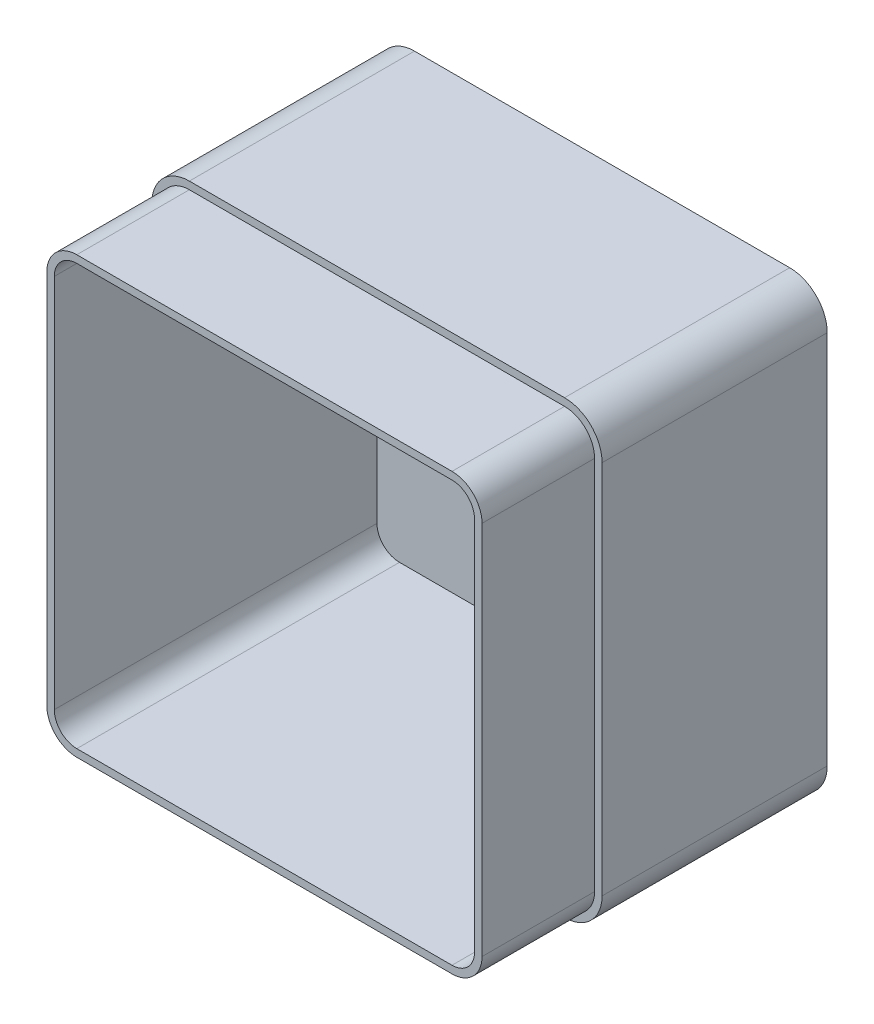
ISO-10303-21;
HEADER;
FILE_DESCRIPTION(('STEP AP214'),'2;1');
FILE_NAME('part.step','',(''),(''),'','','');
FILE_SCHEMA(('AUTOMOTIVE_DESIGN { 1 0 10303 214 1 1 1 1 }'));
ENDSEC;
DATA;
#1=APPLICATION_CONTEXT('core data for automotive mechanical design processes');
#2=APPLICATION_PROTOCOL_DEFINITION('international standard','automotive_design',2000,#1);
#3=PRODUCT_CONTEXT('',#1,'mechanical');
#4=PRODUCT('Part','Part','',(#3));
#5=PRODUCT_RELATED_PRODUCT_CATEGORY('part','',(#4));
#6=PRODUCT_DEFINITION_FORMATION('','',#4);
#7=PRODUCT_DEFINITION_CONTEXT('part definition',#1,'design');
#8=PRODUCT_DEFINITION('design','',#6,#7);
#9=PRODUCT_DEFINITION_SHAPE('','',#8);
#10=(LENGTH_UNIT() NAMED_UNIT(*) SI_UNIT(.MILLI.,.METRE.));
#11=(NAMED_UNIT(*) PLANE_ANGLE_UNIT() SI_UNIT($,.RADIAN.));
#12=(NAMED_UNIT(*) SI_UNIT($,.STERADIAN.) SOLID_ANGLE_UNIT());
#13=UNCERTAINTY_MEASURE_WITH_UNIT(LENGTH_MEASURE(1.E-05),#10,'distance_accuracy_value','');
#14=(GEOMETRIC_REPRESENTATION_CONTEXT(3) GLOBAL_UNCERTAINTY_ASSIGNED_CONTEXT((#13)) GLOBAL_UNIT_ASSIGNED_CONTEXT((#10,
#11,#12)) REPRESENTATION_CONTEXT('',''));
#15=CARTESIAN_POINT('',(0.,0.,0.));
#16=DIRECTION('',(0.,0.,1.));
#17=DIRECTION('',(1.,0.,0.));
#18=AXIS2_PLACEMENT_3D('',#15,#16,#17);
#19=CARTESIAN_POINT('',(0.,120.,90.));
#20=DIRECTION('',(0.,0.,-1.));
#21=DIRECTION('',(-1.,0.,0.));
#22=AXIS2_PLACEMENT_3D('',#19,#20,#21);
#23=PLANE('',#22);
#24=DIRECTION('',(1.,0.,0.));
#25=VECTOR('',#24,1.);
#26=CARTESIAN_POINT('',(0.,4.,90.));
#27=LINE('',#26,#25);
#28=CARTESIAN_POINT('',(9.99999999999999,4.,90.));
#29=VERTEX_POINT('',#28);
#30=CARTESIAN_POINT('',(110.,4.,90.));
#31=VERTEX_POINT('',#30);
#32=EDGE_CURVE('E337',#29,#31,#27,.T.);
#33=ORIENTED_EDGE('',*,*,#32,.F.);
#34=CARTESIAN_POINT('',(10.,10.,90.));
#35=DIRECTION('',(0.,0.,-1.));
#36=DIRECTION('',(-1.,0.,0.));
#37=AXIS2_PLACEMENT_3D('',#34,#35,#36);
#38=CIRCLE('',#37,6.);
#39=CARTESIAN_POINT('',(4.,9.99999999999999,90.));
#40=VERTEX_POINT('',#39);
#41=EDGE_CURVE('E295',#40,#29,#38,.F.);
#42=ORIENTED_EDGE('',*,*,#41,.F.);
#43=DIRECTION('',(0.,-1.,0.));
#44=VECTOR('',#43,1.);
#45=CARTESIAN_POINT('',(4.,120.,90.));
#46=LINE('',#45,#44);
#47=CARTESIAN_POINT('',(4.,110.,90.));
#48=VERTEX_POINT('',#47);
#49=EDGE_CURVE('E317',#48,#40,#46,.T.);
#50=ORIENTED_EDGE('',*,*,#49,.F.);
#51=CARTESIAN_POINT('',(10.,110.,90.));
#52=DIRECTION('',(0.,0.,-1.));
#53=DIRECTION('',(-1.,0.,0.));
#54=AXIS2_PLACEMENT_3D('',#51,#52,#53);
#55=CIRCLE('',#54,6.);
#56=CARTESIAN_POINT('',(9.99999999999999,116.,90.));
#57=VERTEX_POINT('',#56);
#58=EDGE_CURVE('E327',#57,#48,#55,.F.);
#59=ORIENTED_EDGE('',*,*,#58,.F.);
#60=DIRECTION('',(-1.,0.,0.));
#61=VECTOR('',#60,1.);
#62=CARTESIAN_POINT('',(0.,116.,90.));
#63=LINE('',#62,#61);
#64=CARTESIAN_POINT('',(110.,116.,90.));
#65=VERTEX_POINT('',#64);
#66=EDGE_CURVE('E334',#65,#57,#63,.T.);
#67=ORIENTED_EDGE('',*,*,#66,.F.);
#68=CARTESIAN_POINT('',(110.,110.,90.));
#69=DIRECTION('',(0.,0.,-1.));
#70=DIRECTION('',(-1.,0.,0.));
#71=AXIS2_PLACEMENT_3D('',#68,#69,#70);
#72=CIRCLE('',#71,6.);
#73=CARTESIAN_POINT('',(116.,110.,90.));
#74=VERTEX_POINT('',#73);
#75=EDGE_CURVE('E301',#74,#65,#72,.F.);
#76=ORIENTED_EDGE('',*,*,#75,.F.);
#77=DIRECTION('',(0.,1.,0.));
#78=VECTOR('',#77,1.);
#79=CARTESIAN_POINT('',(116.,120.,90.));
#80=LINE('',#79,#78);
#81=CARTESIAN_POINT('',(116.,9.99999999999999,90.));
#82=VERTEX_POINT('',#81);
#83=EDGE_CURVE('E341',#82,#74,#80,.T.);
#84=ORIENTED_EDGE('',*,*,#83,.F.);
#85=CARTESIAN_POINT('',(110.,10.,90.));
#86=DIRECTION('',(0.,0.,-1.));
#87=DIRECTION('',(-1.,0.,0.));
#88=AXIS2_PLACEMENT_3D('',#85,#86,#87);
#89=CIRCLE('',#88,6.);
#90=EDGE_CURVE('E324',#31,#82,#89,.F.);
#91=ORIENTED_EDGE('',*,*,#90,.F.);
#92=EDGE_LOOP('',(#33,#42,#50,#59,#67,#76,#84,#91));
#93=FACE_BOUND('',#92,.T.);
#94=CARTESIAN_POINT('',(10.,10.,90.));
#95=DIRECTION('',(0.,0.,1.));
#96=DIRECTION('',(1.,0.,0.));
#97=AXIS2_PLACEMENT_3D('',#94,#95,#96);
#98=CIRCLE('',#97,8.);
#99=CARTESIAN_POINT('',(2.,9.99999999999999,90.));
#100=VERTEX_POINT('',#99);
#101=CARTESIAN_POINT('',(9.99999999999999,2.,90.));
#102=VERTEX_POINT('',#101);
#103=EDGE_CURVE('E225',#100,#102,#98,.T.);
#104=ORIENTED_EDGE('',*,*,#103,.T.);
#105=DIRECTION('',(1.,0.,0.));
#106=VECTOR('',#105,1.);
#107=CARTESIAN_POINT('',(10.,2.,90.));
#108=LINE('',#107,#106);
#109=CARTESIAN_POINT('',(110.,2.,90.));
#110=VERTEX_POINT('',#109);
#111=EDGE_CURVE('E223',#102,#110,#108,.T.);
#112=ORIENTED_EDGE('',*,*,#111,.T.);
#113=CARTESIAN_POINT('',(110.,10.,90.));
#114=DIRECTION('',(0.,0.,1.));
#115=DIRECTION('',(1.,0.,0.));
#116=AXIS2_PLACEMENT_3D('',#113,#114,#115);
#117=CIRCLE('',#116,7.99999999999999);
#118=CARTESIAN_POINT('',(118.,10.,90.));
#119=VERTEX_POINT('',#118);
#120=EDGE_CURVE('E58',#110,#119,#117,.T.);
#121=ORIENTED_EDGE('',*,*,#120,.T.);
#122=DIRECTION('',(0.,1.,0.));
#123=VECTOR('',#122,1.);
#124=CARTESIAN_POINT('',(118.,10.,90.));
#125=LINE('',#124,#123);
#126=CARTESIAN_POINT('',(118.,110.,90.));
#127=VERTEX_POINT('',#126);
#128=EDGE_CURVE('E213',#119,#127,#125,.T.);
#129=ORIENTED_EDGE('',*,*,#128,.T.);
#130=CARTESIAN_POINT('',(110.,110.,90.));
#131=DIRECTION('',(0.,0.,1.));
#132=DIRECTION('',(1.,0.,0.));
#133=AXIS2_PLACEMENT_3D('',#130,#131,#132);
#134=CIRCLE('',#133,7.99999999999999);
#135=CARTESIAN_POINT('',(110.,118.,90.));
#136=VERTEX_POINT('',#135);
#137=EDGE_CURVE('E218',#127,#136,#134,.T.);
#138=ORIENTED_EDGE('',*,*,#137,.T.);
#139=DIRECTION('',(-1.,0.,0.));
#140=VECTOR('',#139,1.);
#141=CARTESIAN_POINT('',(110.,118.,90.));
#142=LINE('',#141,#140);
#143=CARTESIAN_POINT('',(9.99999999999999,118.,90.));
#144=VERTEX_POINT('',#143);
#145=EDGE_CURVE('E230',#136,#144,#142,.T.);
#146=ORIENTED_EDGE('',*,*,#145,.T.);
#147=CARTESIAN_POINT('',(10.,110.,90.));
#148=DIRECTION('',(0.,0.,1.));
#149=DIRECTION('',(1.,0.,0.));
#150=AXIS2_PLACEMENT_3D('',#147,#148,#149);
#151=CIRCLE('',#150,7.99999999999999);
#152=CARTESIAN_POINT('',(2.,110.,90.));
#153=VERTEX_POINT('',#152);
#154=EDGE_CURVE('E233',#144,#153,#151,.T.);
#155=ORIENTED_EDGE('',*,*,#154,.T.);
#156=DIRECTION('',(0.,-1.,0.));
#157=VECTOR('',#156,1.);
#158=CARTESIAN_POINT('',(2.,110.,90.));
#159=LINE('',#158,#157);
#160=EDGE_CURVE('E236',#153,#100,#159,.T.);
#161=ORIENTED_EDGE('',*,*,#160,.T.);
#162=EDGE_LOOP('',(#104,#112,#121,#129,#138,#146,#155,#161));
#163=FACE_BOUND('',#162,.T.);
#164=ADVANCED_FACE('F43',(#93,#163),#23,.F.);
#165=CARTESIAN_POINT('',(4.,0.,90.));
#166=DIRECTION('',(1.,0.,0.));
#167=DIRECTION('',(0.,0.,-1.));
#168=AXIS2_PLACEMENT_3D('',#165,#166,#167);
#169=PLANE('',#168);
#170=DIRECTION('',(0.,-1.,0.));
#171=VECTOR('',#170,1.);
#172=CARTESIAN_POINT('',(4.,120.,4.));
#173=LINE('',#172,#171);
#174=CARTESIAN_POINT('',(4.,110.,4.));
#175=VERTEX_POINT('',#174);
#176=CARTESIAN_POINT('',(4.,9.99999999999999,4.));
#177=VERTEX_POINT('',#176);
#178=EDGE_CURVE('E288',#175,#177,#173,.T.);
#179=ORIENTED_EDGE('',*,*,#178,.F.);
#180=DIRECTION('',(0.,0.,-1.));
#181=VECTOR('',#180,1.);
#182=CARTESIAN_POINT('',(4.,110.,90.));
#183=LINE('',#182,#181);
#184=EDGE_CURVE('E297',#48,#175,#183,.T.);
#185=ORIENTED_EDGE('',*,*,#184,.F.);
#186=ORIENTED_EDGE('',*,*,#49,.T.);
#187=DIRECTION('',(0.,0.,-1.));
#188=VECTOR('',#187,1.);
#189=CARTESIAN_POINT('',(4.,9.99999999999999,90.));
#190=LINE('',#189,#188);
#191=EDGE_CURVE('E292',#177,#40,#190,.F.);
#192=ORIENTED_EDGE('',*,*,#191,.F.);
#193=EDGE_LOOP('',(#179,#185,#186,#192));
#194=FACE_BOUND('',#193,.T.);
#195=ADVANCED_FACE('F436',(#194),#169,.T.);
#196=CARTESIAN_POINT('',(0.,4.,90.));
#197=DIRECTION('',(0.,1.,0.));
#198=DIRECTION('',(0.,0.,1.));
#199=AXIS2_PLACEMENT_3D('',#196,#197,#198);
#200=PLANE('',#199);
#201=DIRECTION('',(1.,0.,0.));
#202=VECTOR('',#201,1.);
#203=CARTESIAN_POINT('',(0.,4.,4.));
#204=LINE('',#203,#202);
#205=CARTESIAN_POINT('',(9.99999999999999,4.,4.));
#206=VERTEX_POINT('',#205);
#207=CARTESIAN_POINT('',(110.,4.,4.));
#208=VERTEX_POINT('',#207);
#209=EDGE_CURVE('E291',#206,#208,#204,.T.);
#210=ORIENTED_EDGE('',*,*,#209,.F.);
#211=DIRECTION('',(0.,0.,1.));
#212=VECTOR('',#211,1.);
#213=CARTESIAN_POINT('',(9.99999999999999,4.,90.));
#214=LINE('',#213,#212);
#215=EDGE_CURVE('E312',#29,#206,#214,.F.);
#216=ORIENTED_EDGE('',*,*,#215,.F.);
#217=ORIENTED_EDGE('',*,*,#32,.T.);
#218=DIRECTION('',(0.,0.,1.));
#219=VECTOR('',#218,1.);
#220=CARTESIAN_POINT('',(110.,4.,90.));
#221=LINE('',#220,#219);
#222=EDGE_CURVE('E307',#208,#31,#221,.T.);
#223=ORIENTED_EDGE('',*,*,#222,.F.);
#224=EDGE_LOOP('',(#210,#216,#217,#223));
#225=FACE_BOUND('',#224,.T.);
#226=ADVANCED_FACE('F441',(#225),#200,.T.);
#227=CARTESIAN_POINT('',(116.,0.,90.));
#228=DIRECTION('',(-1.,0.,0.));
#229=DIRECTION('',(0.,0.,1.));
#230=AXIS2_PLACEMENT_3D('',#227,#228,#229);
#231=PLANE('',#230);
#232=ORIENTED_EDGE('',*,*,#83,.T.);
#233=DIRECTION('',(0.,0.,1.));
#234=VECTOR('',#233,1.);
#235=CARTESIAN_POINT('',(116.,110.,90.));
#236=LINE('',#235,#234);
#237=CARTESIAN_POINT('',(116.,110.,4.));
#238=VERTEX_POINT('',#237);
#239=EDGE_CURVE('E321',#238,#74,#236,.T.);
#240=ORIENTED_EDGE('',*,*,#239,.F.);
#241=DIRECTION('',(0.,1.,0.));
#242=VECTOR('',#241,1.);
#243=CARTESIAN_POINT('',(116.,120.,4.));
#244=LINE('',#243,#242);
#245=CARTESIAN_POINT('',(116.,9.99999999999999,4.));
#246=VERTEX_POINT('',#245);
#247=EDGE_CURVE('E302',#246,#238,#244,.T.);
#248=ORIENTED_EDGE('',*,*,#247,.F.);
#249=DIRECTION('',(0.,0.,1.));
#250=VECTOR('',#249,1.);
#251=CARTESIAN_POINT('',(116.,9.99999999999999,90.));
#252=LINE('',#251,#250);
#253=EDGE_CURVE('E308',#82,#246,#252,.F.);
#254=ORIENTED_EDGE('',*,*,#253,.F.);
#255=EDGE_LOOP('',(#232,#240,#248,#254));
#256=FACE_BOUND('',#255,.T.);
#257=ADVANCED_FACE('F631',(#256),#231,.T.);
#258=CARTESIAN_POINT('',(0.,116.,90.));
#259=DIRECTION('',(0.,-1.,0.));
#260=DIRECTION('',(0.,0.,-1.));
#261=AXIS2_PLACEMENT_3D('',#258,#259,#260);
#262=PLANE('',#261);
#263=DIRECTION('',(-1.,0.,0.));
#264=VECTOR('',#263,1.);
#265=CARTESIAN_POINT('',(0.,116.,4.));
#266=LINE('',#265,#264);
#267=CARTESIAN_POINT('',(110.,116.,4.));
#268=VERTEX_POINT('',#267);
#269=CARTESIAN_POINT('',(9.99999999999999,116.,4.));
#270=VERTEX_POINT('',#269);
#271=EDGE_CURVE('E304',#268,#270,#266,.T.);
#272=ORIENTED_EDGE('',*,*,#271,.F.);
#273=DIRECTION('',(0.,0.,-1.));
#274=VECTOR('',#273,1.);
#275=CARTESIAN_POINT('',(110.,116.,90.));
#276=LINE('',#275,#274);
#277=EDGE_CURVE('E322',#65,#268,#276,.T.);
#278=ORIENTED_EDGE('',*,*,#277,.F.);
#279=ORIENTED_EDGE('',*,*,#66,.T.);
#280=DIRECTION('',(0.,0.,-1.));
#281=VECTOR('',#280,1.);
#282=CARTESIAN_POINT('',(9.99999999999999,116.,90.));
#283=LINE('',#282,#281);
#284=EDGE_CURVE('E314',#270,#57,#283,.F.);
#285=ORIENTED_EDGE('',*,*,#284,.F.);
#286=EDGE_LOOP('',(#272,#278,#279,#285));
#287=FACE_BOUND('',#286,.T.);
#288=ADVANCED_FACE('F623',(#287),#262,.T.);
#289=CARTESIAN_POINT('',(0.,120.,4.));
#290=DIRECTION('',(0.,0.,-1.));
#291=DIRECTION('',(-1.,0.,0.));
#292=AXIS2_PLACEMENT_3D('',#289,#290,#291);
#293=PLANE('',#292);
#294=ORIENTED_EDGE('',*,*,#247,.T.);
#295=CARTESIAN_POINT('',(110.,110.,4.));
#296=DIRECTION('',(0.,0.,-1.));
#297=DIRECTION('',(-1.,0.,0.));
#298=AXIS2_PLACEMENT_3D('',#295,#296,#297);
#299=CIRCLE('',#298,6.);
#300=EDGE_CURVE('E318',#268,#238,#299,.T.);
#301=ORIENTED_EDGE('',*,*,#300,.F.);
#302=ORIENTED_EDGE('',*,*,#271,.T.);
#303=CARTESIAN_POINT('',(10.,110.,4.));
#304=DIRECTION('',(0.,0.,-1.));
#305=DIRECTION('',(-1.,0.,0.));
#306=AXIS2_PLACEMENT_3D('',#303,#304,#305);
#307=CIRCLE('',#306,6.);
#308=EDGE_CURVE('E300',#175,#270,#307,.T.);
#309=ORIENTED_EDGE('',*,*,#308,.F.);
#310=ORIENTED_EDGE('',*,*,#178,.T.);
#311=CARTESIAN_POINT('',(10.,10.,4.));
#312=DIRECTION('',(0.,0.,-1.));
#313=DIRECTION('',(-1.,0.,0.));
#314=AXIS2_PLACEMENT_3D('',#311,#312,#313);
#315=CIRCLE('',#314,6.);
#316=EDGE_CURVE('E296',#206,#177,#315,.T.);
#317=ORIENTED_EDGE('',*,*,#316,.F.);
#318=ORIENTED_EDGE('',*,*,#209,.T.);
#319=CARTESIAN_POINT('',(110.,10.,4.));
#320=DIRECTION('',(0.,0.,-1.));
#321=DIRECTION('',(-1.,0.,0.));
#322=AXIS2_PLACEMENT_3D('',#319,#320,#321);
#323=CIRCLE('',#322,6.);
#324=EDGE_CURVE('E305',#246,#208,#323,.T.);
#325=ORIENTED_EDGE('',*,*,#324,.F.);
#326=EDGE_LOOP('',(#294,#301,#302,#309,#310,#317,#318,#325));
#327=FACE_BOUND('',#326,.T.);
#328=ADVANCED_FACE('F615',(#327),#293,.F.);
#329=CARTESIAN_POINT('',(110.,110.,90.));
#330=DIRECTION('',(0.,0.,-1.));
#331=DIRECTION('',(-1.,0.,0.));
#332=AXIS2_PLACEMENT_3D('',#329,#330,#331);
#333=CYLINDRICAL_SURFACE('',#332,6.);
#334=ORIENTED_EDGE('',*,*,#75,.T.);
#335=ORIENTED_EDGE('',*,*,#277,.T.);
#336=ORIENTED_EDGE('',*,*,#300,.T.);
#337=ORIENTED_EDGE('',*,*,#239,.T.);
#338=EDGE_LOOP('',(#334,#335,#336,#337));
#339=FACE_BOUND('',#338,.T.);
#340=ADVANCED_FACE('F607',(#339),#333,.F.);
#341=CARTESIAN_POINT('',(10.,110.,90.));
#342=DIRECTION('',(0.,0.,-1.));
#343=DIRECTION('',(-1.,0.,0.));
#344=AXIS2_PLACEMENT_3D('',#341,#342,#343);
#345=CYLINDRICAL_SURFACE('',#344,6.);
#346=ORIENTED_EDGE('',*,*,#58,.T.);
#347=ORIENTED_EDGE('',*,*,#184,.T.);
#348=ORIENTED_EDGE('',*,*,#308,.T.);
#349=ORIENTED_EDGE('',*,*,#284,.T.);
#350=EDGE_LOOP('',(#346,#347,#348,#349));
#351=FACE_BOUND('',#350,.T.);
#352=ADVANCED_FACE('F599',(#351),#345,.F.);
#353=CARTESIAN_POINT('',(10.,10.,90.));
#354=DIRECTION('',(0.,0.,-1.));
#355=DIRECTION('',(-1.,0.,0.));
#356=AXIS2_PLACEMENT_3D('',#353,#354,#355);
#357=CYLINDRICAL_SURFACE('',#356,6.);
#358=ORIENTED_EDGE('',*,*,#41,.T.);
#359=ORIENTED_EDGE('',*,*,#215,.T.);
#360=ORIENTED_EDGE('',*,*,#316,.T.);
#361=ORIENTED_EDGE('',*,*,#191,.T.);
#362=EDGE_LOOP('',(#358,#359,#360,#361));
#363=FACE_BOUND('',#362,.T.);
#364=ADVANCED_FACE('F592',(#363),#357,.F.);
#365=CARTESIAN_POINT('',(110.,10.,90.));
#366=DIRECTION('',(0.,0.,-1.));
#367=DIRECTION('',(-1.,0.,0.));
#368=AXIS2_PLACEMENT_3D('',#365,#366,#367);
#369=CYLINDRICAL_SURFACE('',#368,6.);
#370=ORIENTED_EDGE('',*,*,#90,.T.);
#371=ORIENTED_EDGE('',*,*,#253,.T.);
#372=ORIENTED_EDGE('',*,*,#324,.T.);
#373=ORIENTED_EDGE('',*,*,#222,.T.);
#374=EDGE_LOOP('',(#370,#371,#372,#373));
#375=FACE_BOUND('',#374,.T.);
#376=ADVANCED_FACE('F508',(#375),#369,.F.);
#377=CARTESIAN_POINT('',(60.,60.,60.));
#378=DIRECTION('',(0.,0.,1.));
#379=DIRECTION('',(1.,0.,0.));
#380=AXIS2_PLACEMENT_3D('',#377,#378,#379);
#381=PLANE('',#380);
#382=DIRECTION('',(0.,-1.,0.));
#383=VECTOR('',#382,1.);
#384=CARTESIAN_POINT('',(0.,0.,60.));
#385=LINE('',#384,#383);
#386=CARTESIAN_POINT('',(0.,110.,60.));
#387=VERTEX_POINT('',#386);
#388=CARTESIAN_POINT('',(0.,10.,60.));
#389=VERTEX_POINT('',#388);
#390=EDGE_CURVE('E283',#387,#389,#385,.T.);
#391=ORIENTED_EDGE('',*,*,#390,.T.);
#392=CARTESIAN_POINT('',(10.,10.,60.));
#393=DIRECTION('',(0.,0.,1.));
#394=DIRECTION('',(1.,0.,0.));
#395=AXIS2_PLACEMENT_3D('',#392,#393,#394);
#396=CIRCLE('',#395,10.);
#397=CARTESIAN_POINT('',(10.,0.,60.));
#398=VERTEX_POINT('',#397);
#399=EDGE_CURVE('E275',#398,#389,#396,.F.);
#400=ORIENTED_EDGE('',*,*,#399,.F.);
#401=DIRECTION('',(1.,0.,0.));
#402=VECTOR('',#401,1.);
#403=CARTESIAN_POINT('',(0.,0.,60.));
#404=LINE('',#403,#402);
#405=CARTESIAN_POINT('',(110.,0.,60.));
#406=VERTEX_POINT('',#405);
#407=EDGE_CURVE('E66',#398,#406,#404,.T.);
#408=ORIENTED_EDGE('',*,*,#407,.T.);
#409=CARTESIAN_POINT('',(110.,10.,60.));
#410=DIRECTION('',(0.,0.,1.));
#411=DIRECTION('',(1.,0.,0.));
#412=AXIS2_PLACEMENT_3D('',#409,#410,#411);
#413=CIRCLE('',#412,10.);
#414=CARTESIAN_POINT('',(120.,10.,60.));
#415=VERTEX_POINT('',#414);
#416=EDGE_CURVE('E14',#415,#406,#413,.F.);
#417=ORIENTED_EDGE('',*,*,#416,.F.);
#418=DIRECTION('',(0.,1.,0.));
#419=VECTOR('',#418,1.);
#420=CARTESIAN_POINT('',(120.,0.,60.));
#421=LINE('',#420,#419);
#422=CARTESIAN_POINT('',(120.,110.,60.));
#423=VERTEX_POINT('',#422);
#424=EDGE_CURVE('E263',#415,#423,#421,.T.);
#425=ORIENTED_EDGE('',*,*,#424,.T.);
#426=CARTESIAN_POINT('',(110.,110.,60.));
#427=DIRECTION('',(0.,0.,1.));
#428=DIRECTION('',(1.,0.,0.));
#429=AXIS2_PLACEMENT_3D('',#426,#427,#428);
#430=CIRCLE('',#429,10.);
#431=CARTESIAN_POINT('',(110.,120.,60.));
#432=VERTEX_POINT('',#431);
#433=EDGE_CURVE('E278',#432,#423,#430,.F.);
#434=ORIENTED_EDGE('',*,*,#433,.F.);
#435=DIRECTION('',(-1.,0.,0.));
#436=VECTOR('',#435,1.);
#437=CARTESIAN_POINT('',(0.,120.,60.));
#438=LINE('',#437,#436);
#439=CARTESIAN_POINT('',(10.,120.,60.));
#440=VERTEX_POINT('',#439);
#441=EDGE_CURVE('E281',#432,#440,#438,.T.);
#442=ORIENTED_EDGE('',*,*,#441,.T.);
#443=CARTESIAN_POINT('',(10.,110.,60.));
#444=DIRECTION('',(0.,0.,1.));
#445=DIRECTION('',(1.,0.,0.));
#446=AXIS2_PLACEMENT_3D('',#443,#444,#445);
#447=CIRCLE('',#446,10.);
#448=EDGE_CURVE('E285',#387,#440,#447,.F.);
#449=ORIENTED_EDGE('',*,*,#448,.F.);
#450=EDGE_LOOP('',(#391,#400,#408,#417,#425,#434,#442,#449));
#451=FACE_BOUND('',#450,.T.);
#452=DIRECTION('',(0.,-1.,0.));
#453=VECTOR('',#452,1.);
#454=CARTESIAN_POINT('',(2.,110.,60.));
#455=LINE('',#454,#453);
#456=CARTESIAN_POINT('',(2.,110.,60.));
#457=VERTEX_POINT('',#456);
#458=CARTESIAN_POINT('',(2.,9.99999999999999,60.));
#459=VERTEX_POINT('',#458);
#460=EDGE_CURVE('E257',#457,#459,#455,.T.);
#461=ORIENTED_EDGE('',*,*,#460,.F.);
#462=CARTESIAN_POINT('',(10.,110.,60.));
#463=DIRECTION('',(0.,0.,1.));
#464=DIRECTION('',(1.,0.,0.));
#465=AXIS2_PLACEMENT_3D('',#462,#463,#464);
#466=CIRCLE('',#465,7.99999999999999);
#467=CARTESIAN_POINT('',(9.99999999999999,118.,60.));
#468=VERTEX_POINT('',#467);
#469=EDGE_CURVE('E254',#468,#457,#466,.T.);
#470=ORIENTED_EDGE('',*,*,#469,.F.);
#471=DIRECTION('',(-1.,0.,0.));
#472=VECTOR('',#471,1.);
#473=CARTESIAN_POINT('',(110.,118.,60.));
#474=LINE('',#473,#472);
#475=CARTESIAN_POINT('',(110.,118.,60.));
#476=VERTEX_POINT('',#475);
#477=EDGE_CURVE('E251',#476,#468,#474,.T.);
#478=ORIENTED_EDGE('',*,*,#477,.F.);
#479=CARTESIAN_POINT('',(110.,110.,60.));
#480=DIRECTION('',(0.,0.,1.));
#481=DIRECTION('',(1.,0.,0.));
#482=AXIS2_PLACEMENT_3D('',#479,#480,#481);
#483=CIRCLE('',#482,7.99999999999999);
#484=CARTESIAN_POINT('',(118.,110.,60.));
#485=VERTEX_POINT('',#484);
#486=EDGE_CURVE('E248',#485,#476,#483,.T.);
#487=ORIENTED_EDGE('',*,*,#486,.F.);
#488=DIRECTION('',(0.,1.,0.));
#489=VECTOR('',#488,1.);
#490=CARTESIAN_POINT('',(118.,10.,60.));
#491=LINE('',#490,#489);
#492=CARTESIAN_POINT('',(118.,10.,60.));
#493=VERTEX_POINT('',#492);
#494=EDGE_CURVE('E246',#493,#485,#491,.T.);
#495=ORIENTED_EDGE('',*,*,#494,.F.);
#496=CARTESIAN_POINT('',(110.,10.,60.));
#497=DIRECTION('',(0.,0.,1.));
#498=DIRECTION('',(1.,0.,0.));
#499=AXIS2_PLACEMENT_3D('',#496,#497,#498);
#500=CIRCLE('',#499,7.99999999999999);
#501=CARTESIAN_POINT('',(110.,2.,60.));
#502=VERTEX_POINT('',#501);
#503=EDGE_CURVE('E205',#502,#493,#500,.T.);
#504=ORIENTED_EDGE('',*,*,#503,.F.);
#505=DIRECTION('',(1.,0.,0.));
#506=VECTOR('',#505,1.);
#507=CARTESIAN_POINT('',(10.,2.,60.));
#508=LINE('',#507,#506);
#509=CARTESIAN_POINT('',(10.,2.,60.));
#510=VERTEX_POINT('',#509);
#511=EDGE_CURVE('E242',#510,#502,#508,.T.);
#512=ORIENTED_EDGE('',*,*,#511,.F.);
#513=CARTESIAN_POINT('',(10.,10.,60.));
#514=DIRECTION('',(0.,0.,1.));
#515=DIRECTION('',(1.,0.,0.));
#516=AXIS2_PLACEMENT_3D('',#513,#514,#515);
#517=CIRCLE('',#516,8.);
#518=EDGE_CURVE('E239',#459,#510,#517,.T.);
#519=ORIENTED_EDGE('',*,*,#518,.F.);
#520=EDGE_LOOP('',(#461,#470,#478,#487,#495,#504,#512,#519));
#521=FACE_BOUND('',#520,.T.);
#522=ADVANCED_FACE('F396',(#451,#521),#381,.T.);
#523=CARTESIAN_POINT('',(10.,10.,60.));
#524=DIRECTION('',(0.,0.,1.));
#525=DIRECTION('',(1.,0.,0.));
#526=AXIS2_PLACEMENT_3D('',#523,#524,#525);
#527=CYLINDRICAL_SURFACE('',#526,8.);
#528=ORIENTED_EDGE('',*,*,#103,.F.);
#529=DIRECTION('',(0.,0.,1.));
#530=VECTOR('',#529,1.);
#531=CARTESIAN_POINT('',(2.,9.99999999999999,60.));
#532=LINE('',#531,#530);
#533=EDGE_CURVE('E261',#459,#100,#532,.T.);
#534=ORIENTED_EDGE('',*,*,#533,.F.);
#535=ORIENTED_EDGE('',*,*,#518,.T.);
#536=DIRECTION('',(0.,0.,1.));
#537=VECTOR('',#536,1.);
#538=CARTESIAN_POINT('',(10.,2.,60.));
#539=LINE('',#538,#537);
#540=EDGE_CURVE('E260',#510,#102,#539,.T.);
#541=ORIENTED_EDGE('',*,*,#540,.T.);
#542=EDGE_LOOP('',(#528,#534,#535,#541));
#543=FACE_BOUND('',#542,.T.);
#544=ADVANCED_FACE('F507',(#543),#527,.T.);
#545=CARTESIAN_POINT('',(2.,110.,60.));
#546=DIRECTION('',(-1.,0.,0.));
#547=DIRECTION('',(0.,-1.,0.));
#548=AXIS2_PLACEMENT_3D('',#545,#546,#547);
#549=PLANE('',#548);
#550=ORIENTED_EDGE('',*,*,#160,.F.);
#551=DIRECTION('',(0.,0.,1.));
#552=VECTOR('',#551,1.);
#553=CARTESIAN_POINT('',(2.,110.,60.));
#554=LINE('',#553,#552);
#555=EDGE_CURVE('E264',#457,#153,#554,.T.);
#556=ORIENTED_EDGE('',*,*,#555,.F.);
#557=ORIENTED_EDGE('',*,*,#460,.T.);
#558=ORIENTED_EDGE('',*,*,#533,.T.);
#559=EDGE_LOOP('',(#550,#556,#557,#558));
#560=FACE_BOUND('',#559,.T.);
#561=ADVANCED_FACE('F516',(#560),#549,.T.);
#562=CARTESIAN_POINT('',(10.,110.,60.));
#563=DIRECTION('',(0.,0.,1.));
#564=DIRECTION('',(1.,0.,0.));
#565=AXIS2_PLACEMENT_3D('',#562,#563,#564);
#566=CYLINDRICAL_SURFACE('',#565,7.99999999999999);
#567=ORIENTED_EDGE('',*,*,#154,.F.);
#568=DIRECTION('',(0.,0.,1.));
#569=VECTOR('',#568,1.);
#570=CARTESIAN_POINT('',(9.99999999999999,118.,60.));
#571=LINE('',#570,#569);
#572=EDGE_CURVE('E266',#468,#144,#571,.T.);
#573=ORIENTED_EDGE('',*,*,#572,.F.);
#574=ORIENTED_EDGE('',*,*,#469,.T.);
#575=ORIENTED_EDGE('',*,*,#555,.T.);
#576=EDGE_LOOP('',(#567,#573,#574,#575));
#577=FACE_BOUND('',#576,.T.);
#578=ADVANCED_FACE('F525',(#577),#566,.T.);
#579=CARTESIAN_POINT('',(110.,118.,60.));
#580=DIRECTION('',(0.,1.,0.));
#581=DIRECTION('',(0.,0.,1.));
#582=AXIS2_PLACEMENT_3D('',#579,#580,#581);
#583=PLANE('',#582);
#584=ORIENTED_EDGE('',*,*,#145,.F.);
#585=DIRECTION('',(0.,0.,1.));
#586=VECTOR('',#585,1.);
#587=CARTESIAN_POINT('',(110.,118.,60.));
#588=LINE('',#587,#586);
#589=EDGE_CURVE('E268',#476,#136,#588,.T.);
#590=ORIENTED_EDGE('',*,*,#589,.F.);
#591=ORIENTED_EDGE('',*,*,#477,.T.);
#592=ORIENTED_EDGE('',*,*,#572,.T.);
#593=EDGE_LOOP('',(#584,#590,#591,#592));
#594=FACE_BOUND('',#593,.T.);
#595=ADVANCED_FACE('F534',(#594),#583,.T.);
#596=CARTESIAN_POINT('',(110.,110.,60.));
#597=DIRECTION('',(0.,0.,1.));
#598=DIRECTION('',(1.,0.,0.));
#599=AXIS2_PLACEMENT_3D('',#596,#597,#598);
#600=CYLINDRICAL_SURFACE('',#599,7.99999999999999);
#601=ORIENTED_EDGE('',*,*,#137,.F.);
#602=DIRECTION('',(0.,0.,1.));
#603=VECTOR('',#602,1.);
#604=CARTESIAN_POINT('',(118.,110.,60.));
#605=LINE('',#604,#603);
#606=EDGE_CURVE('E209',#485,#127,#605,.T.);
#607=ORIENTED_EDGE('',*,*,#606,.F.);
#608=ORIENTED_EDGE('',*,*,#486,.T.);
#609=ORIENTED_EDGE('',*,*,#589,.T.);
#610=EDGE_LOOP('',(#601,#607,#608,#609));
#611=FACE_BOUND('',#610,.T.);
#612=ADVANCED_FACE('F543',(#611),#600,.T.);
#613=CARTESIAN_POINT('',(118.,10.,60.));
#614=DIRECTION('',(1.,0.,0.));
#615=DIRECTION('',(0.,0.,-1.));
#616=AXIS2_PLACEMENT_3D('',#613,#614,#615);
#617=PLANE('',#616);
#618=ORIENTED_EDGE('',*,*,#128,.F.);
#619=DIRECTION('',(0.,0.,1.));
#620=VECTOR('',#619,1.);
#621=CARTESIAN_POINT('',(118.,10.,60.));
#622=LINE('',#621,#620);
#623=EDGE_CURVE('E202',#493,#119,#622,.T.);
#624=ORIENTED_EDGE('',*,*,#623,.F.);
#625=ORIENTED_EDGE('',*,*,#494,.T.);
#626=ORIENTED_EDGE('',*,*,#606,.T.);
#627=EDGE_LOOP('',(#618,#624,#625,#626));
#628=FACE_BOUND('',#627,.T.);
#629=ADVANCED_FACE('F214',(#628),#617,.T.);
#630=CARTESIAN_POINT('',(110.,10.,60.));
#631=DIRECTION('',(0.,0.,1.));
#632=DIRECTION('',(1.,0.,0.));
#633=AXIS2_PLACEMENT_3D('',#630,#631,#632);
#634=CYLINDRICAL_SURFACE('',#633,7.99999999999999);
#635=ORIENTED_EDGE('',*,*,#120,.F.);
#636=DIRECTION('',(0.,0.,1.));
#637=VECTOR('',#636,1.);
#638=CARTESIAN_POINT('',(110.,2.,60.));
#639=LINE('',#638,#637);
#640=EDGE_CURVE('E210',#502,#110,#639,.T.);
#641=ORIENTED_EDGE('',*,*,#640,.F.);
#642=ORIENTED_EDGE('',*,*,#503,.T.);
#643=ORIENTED_EDGE('',*,*,#623,.T.);
#644=EDGE_LOOP('',(#635,#641,#642,#643));
#645=FACE_BOUND('',#644,.T.);
#646=ADVANCED_FACE('F204',(#645),#634,.T.);
#647=CARTESIAN_POINT('',(10.,2.,60.));
#648=DIRECTION('',(0.,-1.,0.));
#649=DIRECTION('',(0.,0.,-1.));
#650=AXIS2_PLACEMENT_3D('',#647,#648,#649);
#651=PLANE('',#650);
#652=ORIENTED_EDGE('',*,*,#111,.F.);
#653=ORIENTED_EDGE('',*,*,#540,.F.);
#654=ORIENTED_EDGE('',*,*,#511,.T.);
#655=ORIENTED_EDGE('',*,*,#640,.T.);
#656=EDGE_LOOP('',(#652,#653,#654,#655));
#657=FACE_BOUND('',#656,.T.);
#658=ADVANCED_FACE('F424',(#657),#651,.T.);
#659=CARTESIAN_POINT('',(0.,120.,0.));
#660=DIRECTION('',(0.,0.,-1.));
#661=DIRECTION('',(-1.,0.,0.));
#662=AXIS2_PLACEMENT_3D('',#659,#660,#661);
#663=PLANE('',#662);
#664=DIRECTION('',(0.,1.,0.));
#665=VECTOR('',#664,1.);
#666=CARTESIAN_POINT('',(120.,0.,0.));
#667=LINE('',#666,#665);
#668=CARTESIAN_POINT('',(120.,10.,0.));
#669=VERTEX_POINT('',#668);
#670=CARTESIAN_POINT('',(120.,110.,0.));
#671=VERTEX_POINT('',#670);
#672=EDGE_CURVE('E354',#669,#671,#667,.T.);
#673=ORIENTED_EDGE('',*,*,#672,.F.);
#674=CARTESIAN_POINT('',(110.,10.,0.));
#675=DIRECTION('',(0.,0.,-1.));
#676=DIRECTION('',(-1.,0.,0.));
#677=AXIS2_PLACEMENT_3D('',#674,#675,#676);
#678=CIRCLE('',#677,10.);
#679=CARTESIAN_POINT('',(110.,0.,0.));
#680=VERTEX_POINT('',#679);
#681=EDGE_CURVE('E383',#669,#680,#678,.T.);
#682=ORIENTED_EDGE('',*,*,#681,.T.);
#683=DIRECTION('',(1.,0.,0.));
#684=VECTOR('',#683,1.);
#685=CARTESIAN_POINT('',(0.,0.,0.));
#686=LINE('',#685,#684);
#687=CARTESIAN_POINT('',(10.,0.,0.));
#688=VERTEX_POINT('',#687);
#689=EDGE_CURVE('E351',#688,#680,#686,.T.);
#690=ORIENTED_EDGE('',*,*,#689,.F.);
#691=CARTESIAN_POINT('',(10.,10.,0.));
#692=DIRECTION('',(0.,0.,-1.));
#693=DIRECTION('',(-1.,0.,0.));
#694=AXIS2_PLACEMENT_3D('',#691,#692,#693);
#695=CIRCLE('',#694,10.);
#696=CARTESIAN_POINT('',(0.,10.,0.));
#697=VERTEX_POINT('',#696);
#698=EDGE_CURVE('E376',#688,#697,#695,.T.);
#699=ORIENTED_EDGE('',*,*,#698,.T.);
#700=DIRECTION('',(0.,-1.,0.));
#701=VECTOR('',#700,1.);
#702=CARTESIAN_POINT('',(0.,0.,0.));
#703=LINE('',#702,#701);
#704=CARTESIAN_POINT('',(0.,110.,0.));
#705=VERTEX_POINT('',#704);
#706=EDGE_CURVE('E343',#705,#697,#703,.T.);
#707=ORIENTED_EDGE('',*,*,#706,.F.);
#708=CARTESIAN_POINT('',(10.,110.,0.));
#709=DIRECTION('',(0.,0.,-1.));
#710=DIRECTION('',(-1.,0.,0.));
#711=AXIS2_PLACEMENT_3D('',#708,#709,#710);
#712=CIRCLE('',#711,10.);
#713=CARTESIAN_POINT('',(10.,120.,0.));
#714=VERTEX_POINT('',#713);
#715=EDGE_CURVE('E369',#705,#714,#712,.T.);
#716=ORIENTED_EDGE('',*,*,#715,.T.);
#717=DIRECTION('',(-1.,0.,0.));
#718=VECTOR('',#717,1.);
#719=CARTESIAN_POINT('',(0.,120.,0.));
#720=LINE('',#719,#718);
#721=CARTESIAN_POINT('',(110.,120.,0.));
#722=VERTEX_POINT('',#721);
#723=EDGE_CURVE('E356',#722,#714,#720,.T.);
#724=ORIENTED_EDGE('',*,*,#723,.F.);
#725=CARTESIAN_POINT('',(110.,110.,0.));
#726=DIRECTION('',(0.,0.,-1.));
#727=DIRECTION('',(-1.,0.,0.));
#728=AXIS2_PLACEMENT_3D('',#725,#726,#727);
#729=CIRCLE('',#728,10.);
#730=EDGE_CURVE('E361',#722,#671,#729,.T.);
#731=ORIENTED_EDGE('',*,*,#730,.T.);
#732=EDGE_LOOP('',(#673,#682,#690,#699,#707,#716,#724,#731));
#733=FACE_BOUND('',#732,.T.);
#734=ADVANCED_FACE('F422',(#733),#663,.T.);
#735=CARTESIAN_POINT('',(10.,110.,90.));
#736=DIRECTION('',(0.,0.,-1.));
#737=DIRECTION('',(-1.,0.,0.));
#738=AXIS2_PLACEMENT_3D('',#735,#736,#737);
#739=CYLINDRICAL_SURFACE('',#738,10.);
#740=DIRECTION('',(0.,0.,-1.));
#741=VECTOR('',#740,1.);
#742=CARTESIAN_POINT('',(0.,110.,90.));
#743=LINE('',#742,#741);
#744=EDGE_CURVE('E367',#387,#705,#743,.T.);
#745=ORIENTED_EDGE('',*,*,#744,.F.);
#746=ORIENTED_EDGE('',*,*,#448,.T.);
#747=DIRECTION('',(0.,0.,-1.));
#748=VECTOR('',#747,1.);
#749=CARTESIAN_POINT('',(10.,120.,90.));
#750=LINE('',#749,#748);
#751=EDGE_CURVE('E371',#714,#440,#750,.F.);
#752=ORIENTED_EDGE('',*,*,#751,.F.);
#753=ORIENTED_EDGE('',*,*,#715,.F.);
#754=EDGE_LOOP('',(#745,#746,#752,#753));
#755=FACE_BOUND('',#754,.T.);
#756=ADVANCED_FACE('F413',(#755),#739,.T.);
#757=CARTESIAN_POINT('',(110.,110.,90.));
#758=DIRECTION('',(0.,0.,-1.));
#759=DIRECTION('',(-1.,0.,0.));
#760=AXIS2_PLACEMENT_3D('',#757,#758,#759);
#761=CYLINDRICAL_SURFACE('',#760,10.);
#762=DIRECTION('',(0.,0.,-1.));
#763=VECTOR('',#762,1.);
#764=CARTESIAN_POINT('',(110.,120.,90.));
#765=LINE('',#764,#763);
#766=EDGE_CURVE('E359',#432,#722,#765,.T.);
#767=ORIENTED_EDGE('',*,*,#766,.F.);
#768=ORIENTED_EDGE('',*,*,#433,.T.);
#769=DIRECTION('',(0.,0.,-1.));
#770=VECTOR('',#769,1.);
#771=CARTESIAN_POINT('',(120.,110.,90.));
#772=LINE('',#771,#770);
#773=EDGE_CURVE('E364',#671,#423,#772,.F.);
#774=ORIENTED_EDGE('',*,*,#773,.F.);
#775=ORIENTED_EDGE('',*,*,#730,.F.);
#776=EDGE_LOOP('',(#767,#768,#774,#775));
#777=FACE_BOUND('',#776,.T.);
#778=ADVANCED_FACE('F404',(#777),#761,.T.);
#779=CARTESIAN_POINT('',(0.,120.,90.));
#780=DIRECTION('',(0.,-1.,0.));
#781=DIRECTION('',(0.,0.,-1.));
#782=AXIS2_PLACEMENT_3D('',#779,#780,#781);
#783=PLANE('',#782);
#784=ORIENTED_EDGE('',*,*,#441,.F.);
#785=ORIENTED_EDGE('',*,*,#766,.T.);
#786=ORIENTED_EDGE('',*,*,#723,.T.);
#787=ORIENTED_EDGE('',*,*,#751,.T.);
#788=EDGE_LOOP('',(#784,#785,#786,#787));
#789=FACE_BOUND('',#788,.T.);
#790=ADVANCED_FACE('F408',(#789),#783,.F.);
#791=CARTESIAN_POINT('',(110.,10.,90.));
#792=DIRECTION('',(0.,0.,-1.));
#793=DIRECTION('',(-1.,0.,0.));
#794=AXIS2_PLACEMENT_3D('',#791,#792,#793);
#795=CYLINDRICAL_SURFACE('',#794,10.);
#796=DIRECTION('',(0.,0.,-1.));
#797=VECTOR('',#796,1.);
#798=CARTESIAN_POINT('',(120.,10.,90.));
#799=LINE('',#798,#797);
#800=EDGE_CURVE('E381',#415,#669,#799,.T.);
#801=ORIENTED_EDGE('',*,*,#800,.F.);
#802=ORIENTED_EDGE('',*,*,#416,.T.);
#803=DIRECTION('',(0.,0.,-1.));
#804=VECTOR('',#803,1.);
#805=CARTESIAN_POINT('',(110.,0.,90.));
#806=LINE('',#805,#804);
#807=EDGE_CURVE('E51',#680,#406,#806,.F.);
#808=ORIENTED_EDGE('',*,*,#807,.F.);
#809=ORIENTED_EDGE('',*,*,#681,.F.);
#810=EDGE_LOOP('',(#801,#802,#808,#809));
#811=FACE_BOUND('',#810,.T.);
#812=ADVANCED_FACE('F393',(#811),#795,.T.);
#813=CARTESIAN_POINT('',(120.,0.,90.));
#814=DIRECTION('',(-1.,0.,0.));
#815=DIRECTION('',(0.,0.,1.));
#816=AXIS2_PLACEMENT_3D('',#813,#814,#815);
#817=PLANE('',#816);
#818=ORIENTED_EDGE('',*,*,#424,.F.);
#819=ORIENTED_EDGE('',*,*,#800,.T.);
#820=ORIENTED_EDGE('',*,*,#672,.T.);
#821=ORIENTED_EDGE('',*,*,#773,.T.);
#822=EDGE_LOOP('',(#818,#819,#820,#821));
#823=FACE_BOUND('',#822,.T.);
#824=ADVANCED_FACE('F399',(#823),#817,.F.);
#825=CARTESIAN_POINT('',(10.,10.,90.));
#826=DIRECTION('',(0.,0.,-1.));
#827=DIRECTION('',(-1.,0.,0.));
#828=AXIS2_PLACEMENT_3D('',#825,#826,#827);
#829=CYLINDRICAL_SURFACE('',#828,10.);
#830=DIRECTION('',(0.,0.,-1.));
#831=VECTOR('',#830,1.);
#832=CARTESIAN_POINT('',(10.,0.,90.));
#833=LINE('',#832,#831);
#834=EDGE_CURVE('E374',#398,#688,#833,.T.);
#835=ORIENTED_EDGE('',*,*,#834,.F.);
#836=ORIENTED_EDGE('',*,*,#399,.T.);
#837=DIRECTION('',(0.,0.,-1.));
#838=VECTOR('',#837,1.);
#839=CARTESIAN_POINT('',(0.,10.,90.));
#840=LINE('',#839,#838);
#841=EDGE_CURVE('E378',#697,#389,#840,.F.);
#842=ORIENTED_EDGE('',*,*,#841,.F.);
#843=ORIENTED_EDGE('',*,*,#698,.F.);
#844=EDGE_LOOP('',(#835,#836,#842,#843));
#845=FACE_BOUND('',#844,.T.);
#846=ADVANCED_FACE('F420',(#845),#829,.T.);
#847=CARTESIAN_POINT('',(0.,0.,90.));
#848=DIRECTION('',(0.,1.,0.));
#849=DIRECTION('',(0.,0.,1.));
#850=AXIS2_PLACEMENT_3D('',#847,#848,#849);
#851=PLANE('',#850);
#852=ORIENTED_EDGE('',*,*,#407,.F.);
#853=ORIENTED_EDGE('',*,*,#834,.T.);
#854=ORIENTED_EDGE('',*,*,#689,.T.);
#855=ORIENTED_EDGE('',*,*,#807,.T.);
#856=EDGE_LOOP('',(#852,#853,#854,#855));
#857=FACE_BOUND('',#856,.T.);
#858=ADVANCED_FACE('F387',(#857),#851,.F.);
#859=CARTESIAN_POINT('',(0.,0.,90.));
#860=DIRECTION('',(1.,0.,0.));
#861=DIRECTION('',(0.,0.,-1.));
#862=AXIS2_PLACEMENT_3D('',#859,#860,#861);
#863=PLANE('',#862);
#864=ORIENTED_EDGE('',*,*,#390,.F.);
#865=ORIENTED_EDGE('',*,*,#744,.T.);
#866=ORIENTED_EDGE('',*,*,#706,.T.);
#867=ORIENTED_EDGE('',*,*,#841,.T.);
#868=EDGE_LOOP('',(#864,#865,#866,#867));
#869=FACE_BOUND('',#868,.T.);
#870=ADVANCED_FACE('F45',(#869),#863,.F.);
#871=CLOSED_SHELL('',(#164,#195,#226,#257,#288,#328,#340,#352,#364,#376,#522,#544,#561,#578,
#595,#612,#629,#646,#658,#734,#756,#778,#790,#812,#824,#846,#858,#870));
#872=MANIFOLD_SOLID_BREP('B2',#871);
#873=ADVANCED_BREP_SHAPE_REPRESENTATION('',(#18,#872),#14);
#874=SHAPE_DEFINITION_REPRESENTATION(#9,#873);
ENDSEC;
END-ISO-10303-21;
